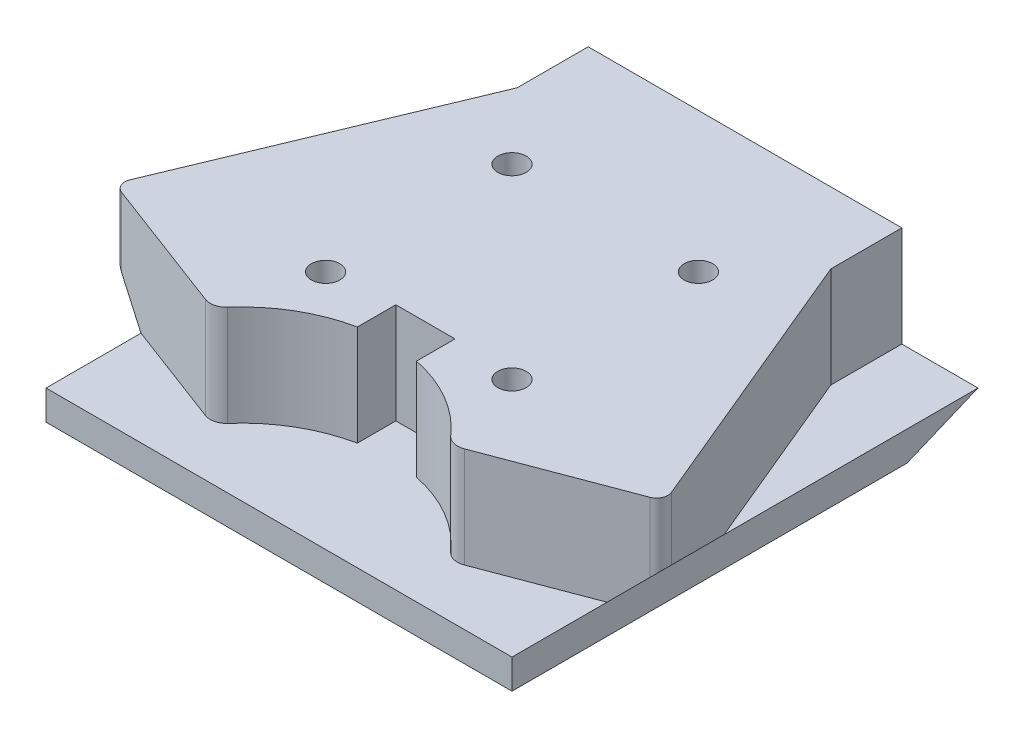
ISO-10303-21;
HEADER;
FILE_DESCRIPTION(('STEP AP214'),'2;1');
FILE_NAME('part.step','',(''),(''),'','','');
FILE_SCHEMA(('AUTOMOTIVE_DESIGN { 1 0 10303 214 1 1 1 1 }'));
ENDSEC;
DATA;
#1=APPLICATION_CONTEXT('core data for automotive mechanical design processes');
#2=APPLICATION_PROTOCOL_DEFINITION('international standard','automotive_design',2000,#1);
#3=PRODUCT_CONTEXT('',#1,'mechanical');
#4=PRODUCT('Part','Part','',(#3));
#5=PRODUCT_RELATED_PRODUCT_CATEGORY('part','',(#4));
#6=PRODUCT_DEFINITION_FORMATION('','',#4);
#7=PRODUCT_DEFINITION_CONTEXT('part definition',#1,'design');
#8=PRODUCT_DEFINITION('design','',#6,#7);
#9=PRODUCT_DEFINITION_SHAPE('','',#8);
#10=(LENGTH_UNIT() NAMED_UNIT(*) SI_UNIT(.MILLI.,.METRE.));
#11=(NAMED_UNIT(*) PLANE_ANGLE_UNIT() SI_UNIT($,.RADIAN.));
#12=(NAMED_UNIT(*) SI_UNIT($,.STERADIAN.) SOLID_ANGLE_UNIT());
#13=UNCERTAINTY_MEASURE_WITH_UNIT(LENGTH_MEASURE(1.E-05),#10,'distance_accuracy_value','');
#14=(GEOMETRIC_REPRESENTATION_CONTEXT(3) GLOBAL_UNCERTAINTY_ASSIGNED_CONTEXT((#13)) GLOBAL_UNIT_ASSIGNED_CONTEXT((#10,
#11,#12)) REPRESENTATION_CONTEXT('',''));
#15=CARTESIAN_POINT('',(0.,0.,0.));
#16=DIRECTION('',(0.,0.,1.));
#17=DIRECTION('',(1.,0.,0.));
#18=AXIS2_PLACEMENT_3D('',#15,#16,#17);
#19=CARTESIAN_POINT('',(0.,10.795,0.));
#20=DIRECTION('',(1.,0.,0.));
#21=DIRECTION('',(0.,0.,-1.));
#22=AXIS2_PLACEMENT_3D('',#19,#20,#21);
#23=PLANE('',#22);
#24=DIRECTION('',(0.,0.,1.));
#25=VECTOR('',#24,1.);
#26=CARTESIAN_POINT('',(0.,0.,0.));
#27=LINE('',#26,#25);
#28=CARTESIAN_POINT('',(0.,0.,0.));
#29=VERTEX_POINT('',#28);
#30=CARTESIAN_POINT('',(0.,0.,7.62));
#31=VERTEX_POINT('',#30);
#32=EDGE_CURVE('E253',#29,#31,#27,.T.);
#33=ORIENTED_EDGE('',*,*,#32,.T.);
#34=DIRECTION('',(0.,-1.,0.));
#35=VECTOR('',#34,1.);
#36=CARTESIAN_POINT('',(0.,10.795,7.62));
#37=LINE('',#36,#35);
#38=CARTESIAN_POINT('',(0.,10.795,7.62));
#39=VERTEX_POINT('',#38);
#40=EDGE_CURVE('E200',#39,#31,#37,.T.);
#41=ORIENTED_EDGE('',*,*,#40,.F.);
#42=DIRECTION('',(0.,0.,1.));
#43=VECTOR('',#42,1.);
#44=CARTESIAN_POINT('',(0.,10.795,0.));
#45=LINE('',#44,#43);
#46=CARTESIAN_POINT('',(0.,10.795,0.));
#47=VERTEX_POINT('',#46);
#48=EDGE_CURVE('E254',#47,#39,#45,.T.);
#49=ORIENTED_EDGE('',*,*,#48,.F.);
#50=DIRECTION('',(0.,-1.,0.));
#51=VECTOR('',#50,1.);
#52=CARTESIAN_POINT('',(0.,10.795,0.));
#53=LINE('',#52,#51);
#54=EDGE_CURVE('E304',#47,#29,#53,.T.);
#55=ORIENTED_EDGE('',*,*,#54,.T.);
#56=EDGE_LOOP('',(#33,#41,#49,#55));
#57=FACE_BOUND('',#56,.T.);
#58=ADVANCED_FACE('F41',(#57),#23,.F.);
#59=CARTESIAN_POINT('',(0.,10.795,7.62));
#60=DIRECTION('',(0.923076923076923,0.,0.384615384615385));
#61=DIRECTION('',(0.384615384615385,0.,-0.923076923076923));
#62=AXIS2_PLACEMENT_3D('',#59,#60,#61);
#63=PLANE('',#62);
#64=DIRECTION('',(-0.384615384615385,0.,0.923076923076923));
#65=VECTOR('',#64,1.);
#66=CARTESIAN_POINT('',(0.,0.,7.62));
#67=LINE('',#66,#65);
#68=CARTESIAN_POINT('',(-8.17245,0.,27.23388));
#69=VERTEX_POINT('',#68);
#70=EDGE_CURVE('E227',#31,#69,#67,.T.);
#71=ORIENTED_EDGE('',*,*,#70,.T.);
#72=DIRECTION('',(-0.358979079308869,0.35897907930887,0.861549790341285));
#73=VECTOR('',#72,1.);
#74=CARTESIAN_POINT('',(-2.44425902061857,-5.72819097938146,13.4862216494846));
#75=LINE('',#74,#73);
#76=CARTESIAN_POINT('',(-12.2273127075269,4.05486270752693,36.9655504980646));
#77=VERTEX_POINT('',#76);
#78=EDGE_CURVE('E194',#69,#77,#75,.T.);
#79=ORIENTED_EDGE('',*,*,#78,.T.);
#80=DIRECTION('',(0.,-1.,0.));
#81=VECTOR('',#80,1.);
#82=CARTESIAN_POINT('',(-12.2273127075269,10.795,36.9655504980646));
#83=LINE('',#82,#81);
#84=CARTESIAN_POINT('',(-12.2273127075269,10.795,36.9655504980646));
#85=VERTEX_POINT('',#84);
#86=EDGE_CURVE('E391',#85,#77,#83,.T.);
#87=ORIENTED_EDGE('',*,*,#86,.F.);
#88=DIRECTION('',(-0.384615384615385,0.,0.923076923076923));
#89=VECTOR('',#88,1.);
#90=CARTESIAN_POINT('',(0.,10.795,7.62));
#91=LINE('',#90,#89);
#92=EDGE_CURVE('E258',#39,#85,#91,.T.);
#93=ORIENTED_EDGE('',*,*,#92,.F.);
#94=ORIENTED_EDGE('',*,*,#40,.T.);
#95=EDGE_LOOP('',(#71,#79,#87,#93,#94));
#96=FACE_BOUND('',#95,.T.);
#97=ADVANCED_FACE('F397',(#96),#63,.F.);
#98=CARTESIAN_POINT('',(-11.0781331559663,10.795,37.3992031590309));
#99=DIRECTION('',(0.,-1.,0.));
#100=DIRECTION('',(0.,0.,-1.));
#101=AXIS2_PLACEMENT_3D('',#98,#99,#100);
#102=CYLINDRICAL_SURFACE('',#101,1.22827858081471);
#103=ORIENTED_EDGE('',*,*,#86,.T.);
#104=CARTESIAN_POINT('',(-11.0781331559663,2.9056831559663,37.3992031590309));
#105=DIRECTION('',(0.707106781186549,0.707106781186546,0.));
#106=DIRECTION('',(0.707106781186546,-0.707106781186549,0.));
#107=AXIS2_PLACEMENT_3D('',#104,#105,#106);
#108=ELLIPSE('',#107,1.73704822736055,1.22827858081471);
#109=CARTESIAN_POINT('',(-11.5117858169326,3.33933581693258,38.5483827105915));
#110=VERTEX_POINT('',#109);
#111=EDGE_CURVE('E215',#77,#110,#108,.T.);
#112=ORIENTED_EDGE('',*,*,#111,.T.);
#113=DIRECTION('',(0.,-1.,0.));
#114=VECTOR('',#113,1.);
#115=CARTESIAN_POINT('',(-11.5117858169326,10.795,38.5483827105915));
#116=LINE('',#115,#114);
#117=CARTESIAN_POINT('',(-11.5117858169326,10.795,38.5483827105915));
#118=VERTEX_POINT('',#117);
#119=EDGE_CURVE('E213',#118,#110,#116,.T.);
#120=ORIENTED_EDGE('',*,*,#119,.F.);
#121=CARTESIAN_POINT('',(-11.0781331559663,10.795,37.3992031590309));
#122=DIRECTION('',(0.,1.,0.));
#123=DIRECTION('',(0.,0.,-1.));
#124=AXIS2_PLACEMENT_3D('',#121,#122,#123);
#125=CIRCLE('',#124,1.22827858081471);
#126=EDGE_CURVE('E262',#85,#118,#125,.T.);
#127=ORIENTED_EDGE('',*,*,#126,.F.);
#128=EDGE_LOOP('',(#103,#112,#120,#127));
#129=FACE_BOUND('',#128,.T.);
#130=ADVANCED_FACE('F518',(#129),#102,.T.);
#131=CARTESIAN_POINT('',(-11.5117858169326,10.795,38.5483827105915));
#132=DIRECTION('',(0.353057252434242,0.,-0.935601718950742));
#133=DIRECTION('',(-0.935601718950742,0.,-0.353057252434242));
#134=AXIS2_PLACEMENT_3D('',#131,#132,#133);
#135=PLANE('',#134);
#136=ORIENTED_EDGE('',*,*,#119,.T.);
#137=DIRECTION('',(0.683203020751499,-0.683203020751501,0.257812460660943));
#138=VECTOR('',#137,1.);
#139=CARTESIAN_POINT('',(-14.9918391054398,6.8193891054398,37.235155054551));
#140=LINE('',#139,#138);
#141=CARTESIAN_POINT('',(-8.17245,0.,39.8085094339623));
#142=VERTEX_POINT('',#141);
#143=EDGE_CURVE('E191',#110,#142,#140,.T.);
#144=ORIENTED_EDGE('',*,*,#143,.T.);
#145=DIRECTION('',(0.935601718950742,0.,0.353057252434242));
#146=VECTOR('',#145,1.);
#147=CARTESIAN_POINT('',(-11.5117858169326,0.,38.5483827105915));
#148=LINE('',#147,#146);
#149=CARTESIAN_POINT('',(2.93928581693256,0.,44.0016172894085));
#150=VERTEX_POINT('',#149);
#151=EDGE_CURVE('E209',#142,#150,#148,.T.);
#152=ORIENTED_EDGE('',*,*,#151,.T.);
#153=DIRECTION('',(0.,-1.,0.));
#154=VECTOR('',#153,1.);
#155=CARTESIAN_POINT('',(2.93928581693256,10.795,44.0016172894085));
#156=LINE('',#155,#154);
#157=CARTESIAN_POINT('',(2.93928581693256,10.795,44.0016172894085));
#158=VERTEX_POINT('',#157);
#159=EDGE_CURVE('E386',#158,#150,#156,.T.);
#160=ORIENTED_EDGE('',*,*,#159,.F.);
#161=DIRECTION('',(0.935601718950742,0.,0.353057252434242));
#162=VECTOR('',#161,1.);
#163=CARTESIAN_POINT('',(-11.5117858169326,10.795,38.5483827105915));
#164=LINE('',#163,#162);
#165=EDGE_CURVE('E265',#118,#158,#164,.T.);
#166=ORIENTED_EDGE('',*,*,#165,.F.);
#167=EDGE_LOOP('',(#136,#144,#152,#160,#166));
#168=FACE_BOUND('',#167,.T.);
#169=ADVANCED_FACE('F207',(#168),#135,.F.);
#170=CARTESIAN_POINT('',(3.56190535190041,10.795,42.3516755217437));
#171=DIRECTION('',(0.,-1.,0.));
#172=DIRECTION('',(0.,0.,-1.));
#173=AXIS2_PLACEMENT_3D('',#170,#171,#172);
#174=CYLINDRICAL_SURFACE('',#173,1.76350869632347);
#175=CARTESIAN_POINT('',(3.56190535190041,0.,42.3516755217437));
#176=DIRECTION('',(0.,1.,0.));
#177=DIRECTION('',(0.,0.,1.));
#178=AXIS2_PLACEMENT_3D('',#175,#176,#177);
#179=CIRCLE('',#178,1.76350869632347);
#180=CARTESIAN_POINT('',(4.84834330146823,0.,43.5579260446121));
#181=VERTEX_POINT('',#180);
#182=EDGE_CURVE('E225',#150,#181,#179,.T.);
#183=ORIENTED_EDGE('',*,*,#182,.T.);
#184=DIRECTION('',(0.,-1.,0.));
#185=VECTOR('',#184,1.);
#186=CARTESIAN_POINT('',(4.84834330146823,10.795,43.5579260446121));
#187=LINE('',#186,#185);
#188=CARTESIAN_POINT('',(4.84834330146823,10.795,43.5579260446121));
#189=VERTEX_POINT('',#188);
#190=EDGE_CURVE('E382',#189,#181,#187,.T.);
#191=ORIENTED_EDGE('',*,*,#190,.F.);
#192=CARTESIAN_POINT('',(3.56190535190041,10.795,42.3516755217437));
#193=DIRECTION('',(0.,1.,0.));
#194=DIRECTION('',(0.,0.,1.));
#195=AXIS2_PLACEMENT_3D('',#192,#193,#194);
#196=CIRCLE('',#195,1.76350869632347);
#197=EDGE_CURVE('E268',#158,#189,#196,.T.);
#198=ORIENTED_EDGE('',*,*,#197,.F.);
#199=ORIENTED_EDGE('',*,*,#159,.T.);
#200=EDGE_LOOP('',(#183,#191,#198,#199));
#201=FACE_BOUND('',#200,.T.);
#202=ADVANCED_FACE('F515',(#201),#174,.T.);
#203=CARTESIAN_POINT('',(16.8275,10.795,53.975));
#204=DIRECTION('',(0.,-1.,0.));
#205=DIRECTION('',(0.,0.,-1.));
#206=AXIS2_PLACEMENT_3D('',#203,#204,#205);
#207=CYLINDRICAL_SURFACE('',#206,15.875);
#208=CARTESIAN_POINT('',(16.8275,0.,53.975));
#209=DIRECTION('',(0.,-1.,0.));
#210=DIRECTION('',(0.,0.,-1.));
#211=AXIS2_PLACEMENT_3D('',#208,#209,#210);
#212=CIRCLE('',#211,15.875);
#213=CARTESIAN_POINT('',(13.6525,0.,38.4207401333268));
#214=VERTEX_POINT('',#213);
#215=EDGE_CURVE('E312',#181,#214,#212,.T.);
#216=ORIENTED_EDGE('',*,*,#215,.T.);
#217=DIRECTION('',(0.,-1.,0.));
#218=VECTOR('',#217,1.);
#219=CARTESIAN_POINT('',(13.6525,10.795,38.4207401333268));
#220=LINE('',#219,#218);
#221=CARTESIAN_POINT('',(13.6525,10.795,38.4207401333268));
#222=VERTEX_POINT('',#221);
#223=EDGE_CURVE('E378',#222,#214,#220,.T.);
#224=ORIENTED_EDGE('',*,*,#223,.F.);
#225=CARTESIAN_POINT('',(16.8275,10.795,53.975));
#226=DIRECTION('',(0.,-1.,0.));
#227=DIRECTION('',(0.,0.,-1.));
#228=AXIS2_PLACEMENT_3D('',#225,#226,#227);
#229=CIRCLE('',#228,15.875);
#230=EDGE_CURVE('E271',#189,#222,#229,.T.);
#231=ORIENTED_EDGE('',*,*,#230,.F.);
#232=ORIENTED_EDGE('',*,*,#190,.T.);
#233=EDGE_LOOP('',(#216,#224,#231,#232));
#234=FACE_BOUND('',#233,.T.);
#235=ADVANCED_FACE('F510',(#234),#207,.F.);
#236=CARTESIAN_POINT('',(13.6525,10.795,34.29));
#237=DIRECTION('',(-1.,0.,0.));
#238=DIRECTION('',(0.,0.,1.));
#239=AXIS2_PLACEMENT_3D('',#236,#237,#238);
#240=PLANE('',#239);
#241=DIRECTION('',(0.,0.,-1.));
#242=VECTOR('',#241,1.);
#243=CARTESIAN_POINT('',(13.6525,0.,34.29));
#244=LINE('',#243,#242);
#245=CARTESIAN_POINT('',(13.6525,0.,34.29));
#246=VERTEX_POINT('',#245);
#247=EDGE_CURVE('E315',#214,#246,#244,.T.);
#248=ORIENTED_EDGE('',*,*,#247,.T.);
#249=DIRECTION('',(0.,-1.,0.));
#250=VECTOR('',#249,1.);
#251=CARTESIAN_POINT('',(13.6525,10.795,34.29));
#252=LINE('',#251,#250);
#253=CARTESIAN_POINT('',(13.6525,10.795,34.29));
#254=VERTEX_POINT('',#253);
#255=EDGE_CURVE('E374',#254,#246,#252,.T.);
#256=ORIENTED_EDGE('',*,*,#255,.F.);
#257=DIRECTION('',(0.,0.,-1.));
#258=VECTOR('',#257,1.);
#259=CARTESIAN_POINT('',(13.6525,10.795,38.1));
#260=LINE('',#259,#258);
#261=EDGE_CURVE('E274',#222,#254,#260,.T.);
#262=ORIENTED_EDGE('',*,*,#261,.F.);
#263=ORIENTED_EDGE('',*,*,#223,.T.);
#264=EDGE_LOOP('',(#248,#256,#262,#263));
#265=FACE_BOUND('',#264,.T.);
#266=ADVANCED_FACE('F507',(#265),#240,.F.);
#267=CARTESIAN_POINT('',(20.0025,10.795,34.29));
#268=DIRECTION('',(0.,0.,-1.));
#269=DIRECTION('',(-1.,0.,0.));
#270=AXIS2_PLACEMENT_3D('',#267,#268,#269);
#271=PLANE('',#270);
#272=DIRECTION('',(1.,0.,0.));
#273=VECTOR('',#272,1.);
#274=CARTESIAN_POINT('',(20.0025,0.,34.29));
#275=LINE('',#274,#273);
#276=CARTESIAN_POINT('',(20.0025,0.,34.29));
#277=VERTEX_POINT('',#276);
#278=EDGE_CURVE('E318',#246,#277,#275,.T.);
#279=ORIENTED_EDGE('',*,*,#278,.T.);
#280=DIRECTION('',(0.,-1.,0.));
#281=VECTOR('',#280,1.);
#282=CARTESIAN_POINT('',(20.0025,10.795,34.29));
#283=LINE('',#282,#281);
#284=CARTESIAN_POINT('',(20.0025,10.795,34.29));
#285=VERTEX_POINT('',#284);
#286=EDGE_CURVE('E370',#285,#277,#283,.T.);
#287=ORIENTED_EDGE('',*,*,#286,.F.);
#288=DIRECTION('',(1.,0.,0.));
#289=VECTOR('',#288,1.);
#290=CARTESIAN_POINT('',(20.0025,10.795,34.29));
#291=LINE('',#290,#289);
#292=EDGE_CURVE('E277',#254,#285,#291,.T.);
#293=ORIENTED_EDGE('',*,*,#292,.F.);
#294=ORIENTED_EDGE('',*,*,#255,.T.);
#295=EDGE_LOOP('',(#279,#287,#293,#294));
#296=FACE_BOUND('',#295,.T.);
#297=ADVANCED_FACE('F503',(#296),#271,.F.);
#298=CARTESIAN_POINT('',(20.0025,10.795,38.1));
#299=DIRECTION('',(1.,0.,0.));
#300=DIRECTION('',(0.,0.,-1.));
#301=AXIS2_PLACEMENT_3D('',#298,#299,#300);
#302=PLANE('',#301);
#303=DIRECTION('',(0.,0.,1.));
#304=VECTOR('',#303,1.);
#305=CARTESIAN_POINT('',(20.0025,0.,38.1));
#306=LINE('',#305,#304);
#307=CARTESIAN_POINT('',(20.0025,0.,38.4207401333268));
#308=VERTEX_POINT('',#307);
#309=EDGE_CURVE('E321',#277,#308,#306,.T.);
#310=ORIENTED_EDGE('',*,*,#309,.T.);
#311=DIRECTION('',(0.,-1.,0.));
#312=VECTOR('',#311,1.);
#313=CARTESIAN_POINT('',(20.0025,10.795,38.4207401333268));
#314=LINE('',#313,#312);
#315=CARTESIAN_POINT('',(20.0025,10.795,38.4207401333268));
#316=VERTEX_POINT('',#315);
#317=EDGE_CURVE('E366',#316,#308,#314,.T.);
#318=ORIENTED_EDGE('',*,*,#317,.F.);
#319=DIRECTION('',(0.,0.,1.));
#320=VECTOR('',#319,1.);
#321=CARTESIAN_POINT('',(20.0025,10.795,38.1));
#322=LINE('',#321,#320);
#323=EDGE_CURVE('E280',#285,#316,#322,.T.);
#324=ORIENTED_EDGE('',*,*,#323,.F.);
#325=ORIENTED_EDGE('',*,*,#286,.T.);
#326=EDGE_LOOP('',(#310,#318,#324,#325));
#327=FACE_BOUND('',#326,.T.);
#328=ADVANCED_FACE('F498',(#327),#302,.F.);
#329=CARTESIAN_POINT('',(16.8275,10.795,53.975));
#330=DIRECTION('',(0.,-1.,0.));
#331=DIRECTION('',(0.,0.,-1.));
#332=AXIS2_PLACEMENT_3D('',#329,#330,#331);
#333=CYLINDRICAL_SURFACE('',#332,15.875);
#334=CARTESIAN_POINT('',(16.8275,0.,53.975));
#335=DIRECTION('',(0.,-1.,0.));
#336=DIRECTION('',(0.,0.,-1.));
#337=AXIS2_PLACEMENT_3D('',#334,#335,#336);
#338=CIRCLE('',#337,15.875);
#339=CARTESIAN_POINT('',(28.8066566985317,0.,43.5579260446121));
#340=VERTEX_POINT('',#339);
#341=EDGE_CURVE('E324',#308,#340,#338,.T.);
#342=ORIENTED_EDGE('',*,*,#341,.T.);
#343=DIRECTION('',(0.,-1.,0.));
#344=VECTOR('',#343,1.);
#345=CARTESIAN_POINT('',(28.8066566985317,10.795,43.5579260446121));
#346=LINE('',#345,#344);
#347=CARTESIAN_POINT('',(28.8066566985317,10.795,43.5579260446121));
#348=VERTEX_POINT('',#347);
#349=EDGE_CURVE('E362',#348,#340,#346,.T.);
#350=ORIENTED_EDGE('',*,*,#349,.F.);
#351=CARTESIAN_POINT('',(16.8275,10.795,53.975));
#352=DIRECTION('',(0.,-1.,0.));
#353=DIRECTION('',(0.,0.,-1.));
#354=AXIS2_PLACEMENT_3D('',#351,#352,#353);
#355=CIRCLE('',#354,15.875);
#356=EDGE_CURVE('E283',#316,#348,#355,.T.);
#357=ORIENTED_EDGE('',*,*,#356,.F.);
#358=ORIENTED_EDGE('',*,*,#317,.T.);
#359=EDGE_LOOP('',(#342,#350,#357,#358));
#360=FACE_BOUND('',#359,.T.);
#361=ADVANCED_FACE('F492',(#360),#333,.F.);
#362=CARTESIAN_POINT('',(30.0930946480997,10.795,42.3516755217433));
#363=DIRECTION('',(0.,-1.,0.));
#364=DIRECTION('',(0.,0.,-1.));
#365=AXIS2_PLACEMENT_3D('',#362,#363,#364);
#366=CYLINDRICAL_SURFACE('',#365,1.76350869632391);
#367=CARTESIAN_POINT('',(30.0930946480997,0.,42.3516755217433));
#368=DIRECTION('',(0.,1.,0.));
#369=DIRECTION('',(0.,0.,-1.));
#370=AXIS2_PLACEMENT_3D('',#367,#368,#369);
#371=CIRCLE('',#370,1.76350869632391);
#372=CARTESIAN_POINT('',(30.7157141830677,0.,44.0016172894085));
#373=VERTEX_POINT('',#372);
#374=EDGE_CURVE('E327',#340,#373,#371,.T.);
#375=ORIENTED_EDGE('',*,*,#374,.T.);
#376=DIRECTION('',(0.,-1.,0.));
#377=VECTOR('',#376,1.);
#378=CARTESIAN_POINT('',(30.7157141830677,10.795,44.0016172894085));
#379=LINE('',#378,#377);
#380=CARTESIAN_POINT('',(30.7157141830677,10.795,44.0016172894085));
#381=VERTEX_POINT('',#380);
#382=EDGE_CURVE('E358',#381,#373,#379,.T.);
#383=ORIENTED_EDGE('',*,*,#382,.F.);
#384=CARTESIAN_POINT('',(30.0930946480997,10.795,42.3516755217433));
#385=DIRECTION('',(0.,1.,0.));
#386=DIRECTION('',(0.,0.,-1.));
#387=AXIS2_PLACEMENT_3D('',#384,#385,#386);
#388=CIRCLE('',#387,1.76350869632391);
#389=EDGE_CURVE('E286',#348,#381,#388,.T.);
#390=ORIENTED_EDGE('',*,*,#389,.F.);
#391=ORIENTED_EDGE('',*,*,#349,.T.);
#392=EDGE_LOOP('',(#375,#383,#390,#391));
#393=FACE_BOUND('',#392,.T.);
#394=ADVANCED_FACE('F488',(#393),#366,.T.);
#395=CARTESIAN_POINT('',(30.7157141830677,10.795,44.0016172894085));
#396=DIRECTION('',(-0.353057252434237,0.,-0.935601718950744));
#397=DIRECTION('',(-0.935601718950744,0.,0.353057252434237));
#398=AXIS2_PLACEMENT_3D('',#395,#396,#397);
#399=PLANE('',#398);
#400=DIRECTION('',(0.935601718950744,0.,-0.353057252434237));
#401=VECTOR('',#400,1.);
#402=CARTESIAN_POINT('',(30.7157141830677,0.,44.0016172894085));
#403=LINE('',#402,#401);
#404=CARTESIAN_POINT('',(41.82745,0.,39.8085094339624));
#405=VERTEX_POINT('',#404);
#406=EDGE_CURVE('E330',#373,#405,#403,.T.);
#407=ORIENTED_EDGE('',*,*,#406,.T.);
#408=DIRECTION('',(0.683203020751504,0.683203020751497,-0.257812460660941));
#409=VECTOR('',#408,1.);
#410=CARTESIAN_POINT('',(40.9410416855208,-0.8864083144792,40.1430031375395));
#411=LINE('',#410,#409);
#412=CARTESIAN_POINT('',(45.1667858169326,3.33933581693252,38.5483827105916));
#413=VERTEX_POINT('',#412);
#414=EDGE_CURVE('E63',#405,#413,#411,.T.);
#415=ORIENTED_EDGE('',*,*,#414,.T.);
#416=DIRECTION('',(0.,-1.,0.));
#417=VECTOR('',#416,1.);
#418=CARTESIAN_POINT('',(45.1667858169326,10.795,38.5483827105916));
#419=LINE('',#418,#417);
#420=CARTESIAN_POINT('',(45.1667858169326,10.795,38.5483827105916));
#421=VERTEX_POINT('',#420);
#422=EDGE_CURVE('E354',#421,#413,#419,.T.);
#423=ORIENTED_EDGE('',*,*,#422,.F.);
#424=DIRECTION('',(0.935601718950744,0.,-0.353057252434237));
#425=VECTOR('',#424,1.);
#426=CARTESIAN_POINT('',(30.7157141830677,10.795,44.0016172894085));
#427=LINE('',#426,#425);
#428=EDGE_CURVE('E289',#381,#421,#427,.T.);
#429=ORIENTED_EDGE('',*,*,#428,.F.);
#430=ORIENTED_EDGE('',*,*,#382,.T.);
#431=EDGE_LOOP('',(#407,#415,#423,#429,#430));
#432=FACE_BOUND('',#431,.T.);
#433=ADVANCED_FACE('F484',(#432),#399,.F.);
#434=CARTESIAN_POINT('',(44.7331331559663,10.795,37.3992031590309));
#435=DIRECTION('',(0.,-1.,0.));
#436=DIRECTION('',(0.,0.,-1.));
#437=AXIS2_PLACEMENT_3D('',#434,#435,#436);
#438=CYLINDRICAL_SURFACE('',#437,1.22827858081479);
#439=ORIENTED_EDGE('',*,*,#422,.T.);
#440=CARTESIAN_POINT('',(44.7331331559663,2.90568315596626,37.3992031590309));
#441=DIRECTION('',(-0.707106781186544,0.707106781186551,0.));
#442=DIRECTION('',(-0.707106781186551,-0.707106781186544,0.));
#443=AXIS2_PLACEMENT_3D('',#440,#441,#442);
#444=ELLIPSE('',#443,1.73704822736064,1.22827858081479);
#445=CARTESIAN_POINT('',(45.882312707527,4.05486270752691,36.9655504980648));
#446=VERTEX_POINT('',#445);
#447=EDGE_CURVE('E448',#413,#446,#444,.T.);
#448=ORIENTED_EDGE('',*,*,#447,.T.);
#449=DIRECTION('',(0.,-1.,0.));
#450=VECTOR('',#449,1.);
#451=CARTESIAN_POINT('',(45.882312707527,10.795,36.9655504980648));
#452=LINE('',#451,#450);
#453=CARTESIAN_POINT('',(45.882312707527,10.795,36.9655504980648));
#454=VERTEX_POINT('',#453);
#455=EDGE_CURVE('E350',#454,#446,#452,.T.);
#456=ORIENTED_EDGE('',*,*,#455,.F.);
#457=CARTESIAN_POINT('',(44.7331331559663,10.795,37.3992031590309));
#458=DIRECTION('',(0.,1.,0.));
#459=DIRECTION('',(0.,0.,1.));
#460=AXIS2_PLACEMENT_3D('',#457,#458,#459);
#461=CIRCLE('',#460,1.22827858081479);
#462=EDGE_CURVE('E292',#421,#454,#461,.T.);
#463=ORIENTED_EDGE('',*,*,#462,.F.);
#464=EDGE_LOOP('',(#439,#448,#456,#463));
#465=FACE_BOUND('',#464,.T.);
#466=ADVANCED_FACE('F468',(#465),#438,.T.);
#467=CARTESIAN_POINT('',(33.6550000000002,10.795,7.6200000000001));
#468=DIRECTION('',(-0.923076923076925,0.,0.384615384615379));
#469=DIRECTION('',(0.384615384615379,0.,0.923076923076925));
#470=AXIS2_PLACEMENT_3D('',#467,#468,#469);
#471=PLANE('',#470);
#472=ORIENTED_EDGE('',*,*,#455,.T.);
#473=DIRECTION('',(-0.358979079308865,-0.358979079308861,-0.86154979034129));
#474=VECTOR('',#473,1.);
#475=CARTESIAN_POINT('',(36.0992590206186,-5.72819097938129,13.4862216494844));
#476=LINE('',#475,#474);
#477=CARTESIAN_POINT('',(41.82745,0.,27.23388));
#478=VERTEX_POINT('',#477);
#479=EDGE_CURVE('E439',#446,#478,#476,.T.);
#480=ORIENTED_EDGE('',*,*,#479,.T.);
#481=DIRECTION('',(-0.384615384615379,0.,-0.923076923076925));
#482=VECTOR('',#481,1.);
#483=CARTESIAN_POINT('',(33.6550000000002,0.,7.6200000000001));
#484=LINE('',#483,#482);
#485=CARTESIAN_POINT('',(33.6550000000002,0.,7.6200000000001));
#486=VERTEX_POINT('',#485);
#487=EDGE_CURVE('E333',#478,#486,#484,.T.);
#488=ORIENTED_EDGE('',*,*,#487,.T.);
#489=DIRECTION('',(0.,-1.,0.));
#490=VECTOR('',#489,1.);
#491=CARTESIAN_POINT('',(33.6550000000002,10.795,7.6200000000001));
#492=LINE('',#491,#490);
#493=CARTESIAN_POINT('',(33.6550000000002,10.795,7.6200000000001));
#494=VERTEX_POINT('',#493);
#495=EDGE_CURVE('E346',#494,#486,#492,.T.);
#496=ORIENTED_EDGE('',*,*,#495,.F.);
#497=DIRECTION('',(-0.384615384615379,0.,-0.923076923076925));
#498=VECTOR('',#497,1.);
#499=CARTESIAN_POINT('',(33.6550000000002,10.795,7.6200000000001));
#500=LINE('',#499,#498);
#501=EDGE_CURVE('E295',#454,#494,#500,.T.);
#502=ORIENTED_EDGE('',*,*,#501,.F.);
#503=EDGE_LOOP('',(#472,#480,#488,#496,#502));
#504=FACE_BOUND('',#503,.T.);
#505=ADVANCED_FACE('F443',(#504),#471,.F.);
#506=CARTESIAN_POINT('',(33.655,10.795,0.));
#507=DIRECTION('',(-1.,0.,0.));
#508=DIRECTION('',(0.,0.,1.));
#509=AXIS2_PLACEMENT_3D('',#506,#507,#508);
#510=PLANE('',#509);
#511=DIRECTION('',(0.,0.,-1.));
#512=VECTOR('',#511,1.);
#513=CARTESIAN_POINT('',(33.655,0.,0.));
#514=LINE('',#513,#512);
#515=CARTESIAN_POINT('',(33.6550000000001,0.,0.));
#516=VERTEX_POINT('',#515);
#517=EDGE_CURVE('E259',#486,#516,#514,.T.);
#518=ORIENTED_EDGE('',*,*,#517,.T.);
#519=DIRECTION('',(0.,-1.,0.));
#520=VECTOR('',#519,1.);
#521=CARTESIAN_POINT('',(33.655,10.795,0.));
#522=LINE('',#521,#520);
#523=CARTESIAN_POINT('',(33.655,10.795,0.));
#524=VERTEX_POINT('',#523);
#525=EDGE_CURVE('E342',#524,#516,#522,.T.);
#526=ORIENTED_EDGE('',*,*,#525,.F.);
#527=DIRECTION('',(0.,0.,-1.));
#528=VECTOR('',#527,1.);
#529=CARTESIAN_POINT('',(33.655,10.795,0.));
#530=LINE('',#529,#528);
#531=EDGE_CURVE('E298',#494,#524,#530,.T.);
#532=ORIENTED_EDGE('',*,*,#531,.F.);
#533=ORIENTED_EDGE('',*,*,#495,.T.);
#534=EDGE_LOOP('',(#518,#526,#532,#533));
#535=FACE_BOUND('',#534,.T.);
#536=ADVANCED_FACE('F456',(#535),#510,.F.);
#537=CARTESIAN_POINT('',(0.,10.795,0.));
#538=DIRECTION('',(0.,0.,1.));
#539=DIRECTION('',(1.,0.,0.));
#540=AXIS2_PLACEMENT_3D('',#537,#538,#539);
#541=PLANE('',#540);
#542=ORIENTED_EDGE('',*,*,#525,.T.);
#543=DIRECTION('',(-1.,0.,0.));
#544=VECTOR('',#543,1.);
#545=CARTESIAN_POINT('',(45.9614117367811,0.,0.));
#546=LINE('',#545,#544);
#547=EDGE_CURVE('E412',#516,#29,#546,.T.);
#548=ORIENTED_EDGE('',*,*,#547,.T.);
#549=ORIENTED_EDGE('',*,*,#54,.F.);
#550=DIRECTION('',(-1.,0.,0.));
#551=VECTOR('',#550,1.);
#552=CARTESIAN_POINT('',(0.,10.795,0.));
#553=LINE('',#552,#551);
#554=EDGE_CURVE('E301',#524,#47,#553,.T.);
#555=ORIENTED_EDGE('',*,*,#554,.F.);
#556=EDGE_LOOP('',(#542,#548,#549,#555));
#557=FACE_BOUND('',#556,.T.);
#558=ADVANCED_FACE('F461',(#557),#541,.F.);
#559=CARTESIAN_POINT('',(-11.0781331559663,10.795,37.3992031590309));
#560=DIRECTION('',(0.,-1.,0.));
#561=DIRECTION('',(0.,0.,-1.));
#562=AXIS2_PLACEMENT_3D('',#559,#560,#561);
#563=PLANE('',#562);
#564=CARTESIAN_POINT('',(26.8275054,10.795,34.9999554));
#565=DIRECTION('',(0.,-1.,0.));
#566=DIRECTION('',(0.,0.,-1.));
#567=AXIS2_PLACEMENT_3D('',#564,#565,#566);
#568=CIRCLE('',#567,1.524);
#569=CARTESIAN_POINT('',(26.8275054,10.795,33.4759554));
#570=VERTEX_POINT('',#569);
#571=EDGE_CURVE('E527',#570,#570,#568,.T.);
#572=ORIENTED_EDGE('',*,*,#571,.T.);
#573=EDGE_LOOP('',(#572));
#574=FACE_BOUND('',#573,.T.);
#575=CARTESIAN_POINT('',(6.8274946,10.795,14.9999446));
#576=DIRECTION('',(0.,-1.,0.));
#577=DIRECTION('',(0.,0.,-1.));
#578=AXIS2_PLACEMENT_3D('',#575,#576,#577);
#579=CIRCLE('',#578,1.524);
#580=CARTESIAN_POINT('',(6.8274946,10.795,13.4759446));
#581=VERTEX_POINT('',#580);
#582=EDGE_CURVE('E535',#581,#581,#579,.T.);
#583=ORIENTED_EDGE('',*,*,#582,.T.);
#584=EDGE_LOOP('',(#583));
#585=FACE_BOUND('',#584,.T.);
#586=CARTESIAN_POINT('',(26.8275054,10.795,14.9999446));
#587=DIRECTION('',(0.,-1.,0.));
#588=DIRECTION('',(0.,0.,-1.));
#589=AXIS2_PLACEMENT_3D('',#586,#587,#588);
#590=CIRCLE('',#589,1.524);
#591=CARTESIAN_POINT('',(26.8275054,10.795,13.4759446));
#592=VERTEX_POINT('',#591);
#593=EDGE_CURVE('E536',#592,#592,#590,.T.);
#594=ORIENTED_EDGE('',*,*,#593,.T.);
#595=EDGE_LOOP('',(#594));
#596=FACE_BOUND('',#595,.T.);
#597=CARTESIAN_POINT('',(6.8274946,10.795,34.9999554));
#598=DIRECTION('',(0.,-1.,0.));
#599=DIRECTION('',(0.,0.,-1.));
#600=AXIS2_PLACEMENT_3D('',#597,#598,#599);
#601=CIRCLE('',#600,1.524);
#602=CARTESIAN_POINT('',(6.8274946,10.795,33.4759554));
#603=VERTEX_POINT('',#602);
#604=EDGE_CURVE('E216',#603,#603,#601,.T.);
#605=ORIENTED_EDGE('',*,*,#604,.T.);
#606=EDGE_LOOP('',(#605));
#607=FACE_BOUND('',#606,.T.);
#608=ORIENTED_EDGE('',*,*,#48,.T.);
#609=ORIENTED_EDGE('',*,*,#92,.T.);
#610=ORIENTED_EDGE('',*,*,#126,.T.);
#611=ORIENTED_EDGE('',*,*,#165,.T.);
#612=ORIENTED_EDGE('',*,*,#197,.T.);
#613=ORIENTED_EDGE('',*,*,#230,.T.);
#614=ORIENTED_EDGE('',*,*,#261,.T.);
#615=ORIENTED_EDGE('',*,*,#292,.T.);
#616=ORIENTED_EDGE('',*,*,#323,.T.);
#617=ORIENTED_EDGE('',*,*,#356,.T.);
#618=ORIENTED_EDGE('',*,*,#389,.T.);
#619=ORIENTED_EDGE('',*,*,#428,.T.);
#620=ORIENTED_EDGE('',*,*,#462,.T.);
#621=ORIENTED_EDGE('',*,*,#501,.T.);
#622=ORIENTED_EDGE('',*,*,#531,.T.);
#623=ORIENTED_EDGE('',*,*,#554,.T.);
#624=EDGE_LOOP('',(#608,#609,#610,#611,#612,#613,#614,#615,#616,#617,#618,#619,#620,#621,#622,#623));
#625=FACE_BOUND('',#624,.T.);
#626=ADVANCED_FACE('F463',(#574,#585,#596,#607,#625),#563,.F.);
#627=CARTESIAN_POINT('',(0.,0.,0.));
#628=DIRECTION('',(0.,1.,0.));
#629=DIRECTION('',(0.,0.,1.));
#630=AXIS2_PLACEMENT_3D('',#627,#628,#629);
#631=PLANE('',#630);
#632=ORIENTED_EDGE('',*,*,#517,.F.);
#633=ORIENTED_EDGE('',*,*,#487,.F.);
#634=DIRECTION('',(0.,0.,1.));
#635=VECTOR('',#634,1.);
#636=CARTESIAN_POINT('',(41.82745,0.,49.9999));
#637=LINE('',#636,#635);
#638=CARTESIAN_POINT('',(41.82745,0.,0.));
#639=VERTEX_POINT('',#638);
#640=EDGE_CURVE('E424',#639,#478,#637,.T.);
#641=ORIENTED_EDGE('',*,*,#640,.F.);
#642=DIRECTION('',(1.,0.,0.));
#643=VECTOR('',#642,1.);
#644=CARTESIAN_POINT('',(16.8275,0.,0.));
#645=LINE('',#644,#643);
#646=EDGE_CURVE('E235',#516,#639,#645,.T.);
#647=ORIENTED_EDGE('',*,*,#646,.F.);
#648=EDGE_LOOP('',(#632,#633,#641,#647));
#649=FACE_BOUND('',#648,.T.);
#650=ADVANCED_FACE('F452',(#649),#631,.T.);
#651=ORIENTED_EDGE('',*,*,#406,.F.);
#652=ORIENTED_EDGE('',*,*,#374,.F.);
#653=ORIENTED_EDGE('',*,*,#341,.F.);
#654=ORIENTED_EDGE('',*,*,#309,.F.);
#655=ORIENTED_EDGE('',*,*,#278,.F.);
#656=ORIENTED_EDGE('',*,*,#247,.F.);
#657=ORIENTED_EDGE('',*,*,#215,.F.);
#658=ORIENTED_EDGE('',*,*,#182,.F.);
#659=ORIENTED_EDGE('',*,*,#151,.F.);
#660=DIRECTION('',(0.,0.,-1.));
#661=VECTOR('',#660,1.);
#662=CARTESIAN_POINT('',(-8.17245,0.,0.));
#663=LINE('',#662,#661);
#664=CARTESIAN_POINT('',(-8.17245,0.,49.9999));
#665=VERTEX_POINT('',#664);
#666=EDGE_CURVE('E202',#665,#142,#663,.T.);
#667=ORIENTED_EDGE('',*,*,#666,.F.);
#668=DIRECTION('',(-1.,0.,0.));
#669=VECTOR('',#668,1.);
#670=CARTESIAN_POINT('',(-8.17245,0.,49.9999));
#671=LINE('',#670,#669);
#672=CARTESIAN_POINT('',(41.82745,0.,49.9999));
#673=VERTEX_POINT('',#672);
#674=EDGE_CURVE('E240',#673,#665,#671,.T.);
#675=ORIENTED_EDGE('',*,*,#674,.F.);
#676=EDGE_CURVE('E427',#405,#673,#637,.T.);
#677=ORIENTED_EDGE('',*,*,#676,.F.);
#678=EDGE_LOOP('',(#651,#652,#653,#654,#655,#656,#657,#658,#659,#667,#675,#677));
#679=FACE_BOUND('',#678,.T.);
#680=ADVANCED_FACE('F222',(#679),#631,.T.);
#681=ORIENTED_EDGE('',*,*,#32,.F.);
#682=CARTESIAN_POINT('',(-8.17245,0.,0.));
#683=VERTEX_POINT('',#682);
#684=EDGE_CURVE('E238',#683,#29,#645,.T.);
#685=ORIENTED_EDGE('',*,*,#684,.F.);
#686=EDGE_CURVE('E203',#69,#683,#663,.T.);
#687=ORIENTED_EDGE('',*,*,#686,.F.);
#688=ORIENTED_EDGE('',*,*,#70,.F.);
#689=EDGE_LOOP('',(#681,#685,#687,#688));
#690=FACE_BOUND('',#689,.T.);
#691=ADVANCED_FACE('F407',(#690),#631,.T.);
#692=CARTESIAN_POINT('',(41.82745,-3.175,49.9999));
#693=DIRECTION('',(-1.,0.,0.));
#694=DIRECTION('',(0.,0.,1.));
#695=AXIS2_PLACEMENT_3D('',#692,#693,#694);
#696=PLANE('',#695);
#697=DIRECTION('',(0.,0.,1.));
#698=VECTOR('',#697,1.);
#699=CARTESIAN_POINT('',(41.82745,-3.175,49.9999));
#700=LINE('',#699,#698);
#701=CARTESIAN_POINT('',(41.82745,-3.175,7.62000000000002));
#702=VERTEX_POINT('',#701);
#703=CARTESIAN_POINT('',(41.82745,-3.175,49.9999));
#704=VERTEX_POINT('',#703);
#705=EDGE_CURVE('E245',#702,#704,#700,.T.);
#706=ORIENTED_EDGE('',*,*,#705,.F.);
#707=DIRECTION('',(0.,0.384615384615384,-0.923076923076923));
#708=VECTOR('',#707,1.);
#709=CARTESIAN_POINT('',(41.82745,-18.2211183431952,43.7306840236687));
#710=LINE('',#709,#708);
#711=EDGE_CURVE('E56',#702,#639,#710,.T.);
#712=ORIENTED_EDGE('',*,*,#711,.T.);
#713=ORIENTED_EDGE('',*,*,#640,.T.);
#714=EDGE_CURVE('E49',#478,#405,#637,.T.);
#715=ORIENTED_EDGE('',*,*,#714,.T.);
#716=ORIENTED_EDGE('',*,*,#676,.T.);
#717=DIRECTION('',(0.,1.,0.));
#718=VECTOR('',#717,1.);
#719=CARTESIAN_POINT('',(41.82745,-3.175,49.9999));
#720=LINE('',#719,#718);
#721=EDGE_CURVE('E248',#704,#673,#720,.T.);
#722=ORIENTED_EDGE('',*,*,#721,.F.);
#723=EDGE_LOOP('',(#706,#712,#713,#715,#716,#722));
#724=FACE_BOUND('',#723,.T.);
#725=ADVANCED_FACE('F434',(#724),#696,.F.);
#726=CARTESIAN_POINT('',(-8.17245,-3.175,49.9999));
#727=DIRECTION('',(0.,0.,-1.));
#728=DIRECTION('',(-1.,0.,0.));
#729=AXIS2_PLACEMENT_3D('',#726,#727,#728);
#730=PLANE('',#729);
#731=ORIENTED_EDGE('',*,*,#674,.T.);
#732=DIRECTION('',(0.,1.,0.));
#733=VECTOR('',#732,1.);
#734=CARTESIAN_POINT('',(-8.17245,-3.175,49.9999));
#735=LINE('',#734,#733);
#736=CARTESIAN_POINT('',(-8.17245,-3.175,49.9999));
#737=VERTEX_POINT('',#736);
#738=EDGE_CURVE('E233',#737,#665,#735,.T.);
#739=ORIENTED_EDGE('',*,*,#738,.F.);
#740=DIRECTION('',(-1.,0.,0.));
#741=VECTOR('',#740,1.);
#742=CARTESIAN_POINT('',(-8.17245,-3.175,49.9999));
#743=LINE('',#742,#741);
#744=EDGE_CURVE('E418',#704,#737,#743,.T.);
#745=ORIENTED_EDGE('',*,*,#744,.F.);
#746=ORIENTED_EDGE('',*,*,#721,.T.);
#747=EDGE_LOOP('',(#731,#739,#745,#746));
#748=FACE_BOUND('',#747,.T.);
#749=ADVANCED_FACE('F480',(#748),#730,.F.);
#750=CARTESIAN_POINT('',(-8.17245,-3.175,0.));
#751=DIRECTION('',(1.,0.,0.));
#752=DIRECTION('',(0.,0.,-1.));
#753=AXIS2_PLACEMENT_3D('',#750,#751,#752);
#754=PLANE('',#753);
#755=ORIENTED_EDGE('',*,*,#686,.T.);
#756=DIRECTION('',(0.,0.384615384615384,-0.923076923076923));
#757=VECTOR('',#756,1.);
#758=CARTESIAN_POINT('',(-8.17245,-3.175,7.62000000000001));
#759=LINE('',#758,#757);
#760=CARTESIAN_POINT('',(-8.17245,-3.175,7.62000000000001));
#761=VERTEX_POINT('',#760);
#762=EDGE_CURVE('E409',#761,#683,#759,.T.);
#763=ORIENTED_EDGE('',*,*,#762,.F.);
#764=DIRECTION('',(0.,0.,-1.));
#765=VECTOR('',#764,1.);
#766=CARTESIAN_POINT('',(-8.17245,-3.175,0.));
#767=LINE('',#766,#765);
#768=EDGE_CURVE('E249',#737,#761,#767,.T.);
#769=ORIENTED_EDGE('',*,*,#768,.F.);
#770=ORIENTED_EDGE('',*,*,#738,.T.);
#771=ORIENTED_EDGE('',*,*,#666,.T.);
#772=EDGE_CURVE('E188',#142,#69,#663,.T.);
#773=ORIENTED_EDGE('',*,*,#772,.T.);
#774=EDGE_LOOP('',(#755,#763,#769,#770,#771,#773));
#775=FACE_BOUND('',#774,.T.);
#776=ADVANCED_FACE('F230',(#775),#754,.F.);
#777=CARTESIAN_POINT('',(0.,-3.175,0.));
#778=DIRECTION('',(0.,1.,0.));
#779=DIRECTION('',(0.,0.,1.));
#780=AXIS2_PLACEMENT_3D('',#777,#778,#779);
#781=PLANE('',#780);
#782=CARTESIAN_POINT('',(26.8275054,-3.175,34.9999554));
#783=DIRECTION('',(0.,-1.,0.));
#784=DIRECTION('',(0.,0.,-1.));
#785=AXIS2_PLACEMENT_3D('',#782,#783,#784);
#786=CIRCLE('',#785,1.524);
#787=CARTESIAN_POINT('',(26.8275054,-3.175,33.4759554));
#788=VERTEX_POINT('',#787);
#789=EDGE_CURVE('E540',#788,#788,#786,.T.);
#790=ORIENTED_EDGE('',*,*,#789,.F.);
#791=EDGE_LOOP('',(#790));
#792=FACE_BOUND('',#791,.T.);
#793=CARTESIAN_POINT('',(6.8274946,-3.175,14.9999446));
#794=DIRECTION('',(0.,-1.,0.));
#795=DIRECTION('',(0.,0.,-1.));
#796=AXIS2_PLACEMENT_3D('',#793,#794,#795);
#797=CIRCLE('',#796,1.524);
#798=CARTESIAN_POINT('',(6.8274946,-3.175,13.4759446));
#799=VERTEX_POINT('',#798);
#800=EDGE_CURVE('E531',#799,#799,#797,.T.);
#801=ORIENTED_EDGE('',*,*,#800,.F.);
#802=EDGE_LOOP('',(#801));
#803=FACE_BOUND('',#802,.T.);
#804=CARTESIAN_POINT('',(26.8275054,-3.175,14.9999446));
#805=DIRECTION('',(0.,-1.,0.));
#806=DIRECTION('',(0.,0.,-1.));
#807=AXIS2_PLACEMENT_3D('',#804,#805,#806);
#808=CIRCLE('',#807,1.524);
#809=CARTESIAN_POINT('',(26.8275054,-3.175,13.4759446));
#810=VERTEX_POINT('',#809);
#811=EDGE_CURVE('E547',#810,#810,#808,.T.);
#812=ORIENTED_EDGE('',*,*,#811,.F.);
#813=EDGE_LOOP('',(#812));
#814=FACE_BOUND('',#813,.T.);
#815=CARTESIAN_POINT('',(6.8274946,-3.175,34.9999554));
#816=DIRECTION('',(0.,-1.,0.));
#817=DIRECTION('',(0.,0.,-1.));
#818=AXIS2_PLACEMENT_3D('',#815,#816,#817);
#819=CIRCLE('',#818,1.524);
#820=CARTESIAN_POINT('',(6.8274946,-3.175,33.4759554));
#821=VERTEX_POINT('',#820);
#822=EDGE_CURVE('E523',#821,#821,#819,.T.);
#823=ORIENTED_EDGE('',*,*,#822,.F.);
#824=EDGE_LOOP('',(#823));
#825=FACE_BOUND('',#824,.T.);
#826=ORIENTED_EDGE('',*,*,#768,.T.);
#827=DIRECTION('',(1.,0.,0.));
#828=VECTOR('',#827,1.);
#829=CARTESIAN_POINT('',(0.,-3.175,7.62000000000001));
#830=LINE('',#829,#828);
#831=EDGE_CURVE('E11',#761,#702,#830,.T.);
#832=ORIENTED_EDGE('',*,*,#831,.T.);
#833=ORIENTED_EDGE('',*,*,#705,.T.);
#834=ORIENTED_EDGE('',*,*,#744,.T.);
#835=EDGE_LOOP('',(#826,#832,#833,#834));
#836=FACE_BOUND('',#835,.T.);
#837=ADVANCED_FACE('F415',(#792,#803,#814,#825,#836),#781,.F.);
#838=CARTESIAN_POINT('',(45.9614117367811,-3.175,7.62000000000001));
#839=DIRECTION('',(0.,0.923076923076923,0.384615384615384));
#840=DIRECTION('',(0.,-0.384615384615384,0.923076923076923));
#841=AXIS2_PLACEMENT_3D('',#838,#839,#840);
#842=PLANE('',#841);
#843=ORIENTED_EDGE('',*,*,#831,.F.);
#844=ORIENTED_EDGE('',*,*,#762,.T.);
#845=ORIENTED_EDGE('',*,*,#684,.T.);
#846=ORIENTED_EDGE('',*,*,#547,.F.);
#847=ORIENTED_EDGE('',*,*,#646,.T.);
#848=ORIENTED_EDGE('',*,*,#711,.F.);
#849=EDGE_LOOP('',(#843,#844,#845,#846,#847,#848));
#850=FACE_BOUND('',#849,.T.);
#851=ADVANCED_FACE('F567',(#850),#842,.F.);
#852=CARTESIAN_POINT('',(-8.17245,0.,49.9999));
#853=DIRECTION('',(0.707106781186549,0.707106781186546,0.));
#854=DIRECTION('',(-0.707106781186546,0.707106781186549,0.));
#855=AXIS2_PLACEMENT_3D('',#852,#853,#854);
#856=PLANE('',#855);
#857=ORIENTED_EDGE('',*,*,#772,.F.);
#858=ORIENTED_EDGE('',*,*,#143,.F.);
#859=ORIENTED_EDGE('',*,*,#111,.F.);
#860=ORIENTED_EDGE('',*,*,#78,.F.);
#861=EDGE_LOOP('',(#857,#858,#859,#860));
#862=FACE_BOUND('',#861,.T.);
#863=ADVANCED_FACE('F190',(#862),#856,.F.);
#864=CARTESIAN_POINT('',(41.82745,0.,49.9999));
#865=DIRECTION('',(-0.707106781186544,0.707106781186551,0.));
#866=DIRECTION('',(-0.707106781186551,-0.707106781186544,0.));
#867=AXIS2_PLACEMENT_3D('',#864,#865,#866);
#868=PLANE('',#867);
#869=ORIENTED_EDGE('',*,*,#714,.F.);
#870=ORIENTED_EDGE('',*,*,#479,.F.);
#871=ORIENTED_EDGE('',*,*,#447,.F.);
#872=ORIENTED_EDGE('',*,*,#414,.F.);
#873=EDGE_LOOP('',(#869,#870,#871,#872));
#874=FACE_BOUND('',#873,.T.);
#875=ADVANCED_FACE('F438',(#874),#868,.F.);
#876=CARTESIAN_POINT('',(6.8274946,10.795,34.9999554));
#877=DIRECTION('',(0.,-1.,0.));
#878=DIRECTION('',(0.,0.,-1.));
#879=AXIS2_PLACEMENT_3D('',#876,#877,#878);
#880=CYLINDRICAL_SURFACE('',#879,1.524);
#881=ORIENTED_EDGE('',*,*,#604,.F.);
#882=EDGE_LOOP('',(#881));
#883=FACE_BOUND('',#882,.T.);
#884=ORIENTED_EDGE('',*,*,#822,.T.);
#885=EDGE_LOOP('',(#884));
#886=FACE_BOUND('',#885,.T.);
#887=ADVANCED_FACE('F561',(#883,#886),#880,.F.);
#888=CARTESIAN_POINT('',(26.8275054,10.795,14.9999446));
#889=DIRECTION('',(0.,-1.,0.));
#890=DIRECTION('',(0.,0.,-1.));
#891=AXIS2_PLACEMENT_3D('',#888,#889,#890);
#892=CYLINDRICAL_SURFACE('',#891,1.524);
#893=ORIENTED_EDGE('',*,*,#593,.F.);
#894=EDGE_LOOP('',(#893));
#895=FACE_BOUND('',#894,.T.);
#896=ORIENTED_EDGE('',*,*,#811,.T.);
#897=EDGE_LOOP('',(#896));
#898=FACE_BOUND('',#897,.T.);
#899=ADVANCED_FACE('F557',(#895,#898),#892,.F.);
#900=CARTESIAN_POINT('',(6.8274946,10.795,14.9999446));
#901=DIRECTION('',(0.,-1.,0.));
#902=DIRECTION('',(0.,0.,-1.));
#903=AXIS2_PLACEMENT_3D('',#900,#901,#902);
#904=CYLINDRICAL_SURFACE('',#903,1.524);
#905=ORIENTED_EDGE('',*,*,#582,.F.);
#906=EDGE_LOOP('',(#905));
#907=FACE_BOUND('',#906,.T.);
#908=ORIENTED_EDGE('',*,*,#800,.T.);
#909=EDGE_LOOP('',(#908));
#910=FACE_BOUND('',#909,.T.);
#911=ADVANCED_FACE('F560',(#907,#910),#904,.F.);
#912=CARTESIAN_POINT('',(26.8275054,10.795,34.9999554));
#913=DIRECTION('',(0.,-1.,0.));
#914=DIRECTION('',(0.,0.,-1.));
#915=AXIS2_PLACEMENT_3D('',#912,#913,#914);
#916=CYLINDRICAL_SURFACE('',#915,1.524);
#917=ORIENTED_EDGE('',*,*,#571,.F.);
#918=EDGE_LOOP('',(#917));
#919=FACE_BOUND('',#918,.T.);
#920=ORIENTED_EDGE('',*,*,#789,.T.);
#921=EDGE_LOOP('',(#920));
#922=FACE_BOUND('',#921,.T.);
#923=ADVANCED_FACE('F675',(#919,#922),#916,.F.);
#924=CLOSED_SHELL('',(#58,#97,#130,#169,#202,#235,#266,#297,#328,#361,#394,#433,#466,#505,#536,
#558,#626,#650,#680,#691,#725,#749,#776,#837,#851,#863,#875,#887,#899,#911,#923));
#925=MANIFOLD_SOLID_BREP('B2',#924);
#926=ADVANCED_BREP_SHAPE_REPRESENTATION('',(#18,#925),#14);
#927=SHAPE_DEFINITION_REPRESENTATION(#9,#926);
ENDSEC;
END-ISO-10303-21;
